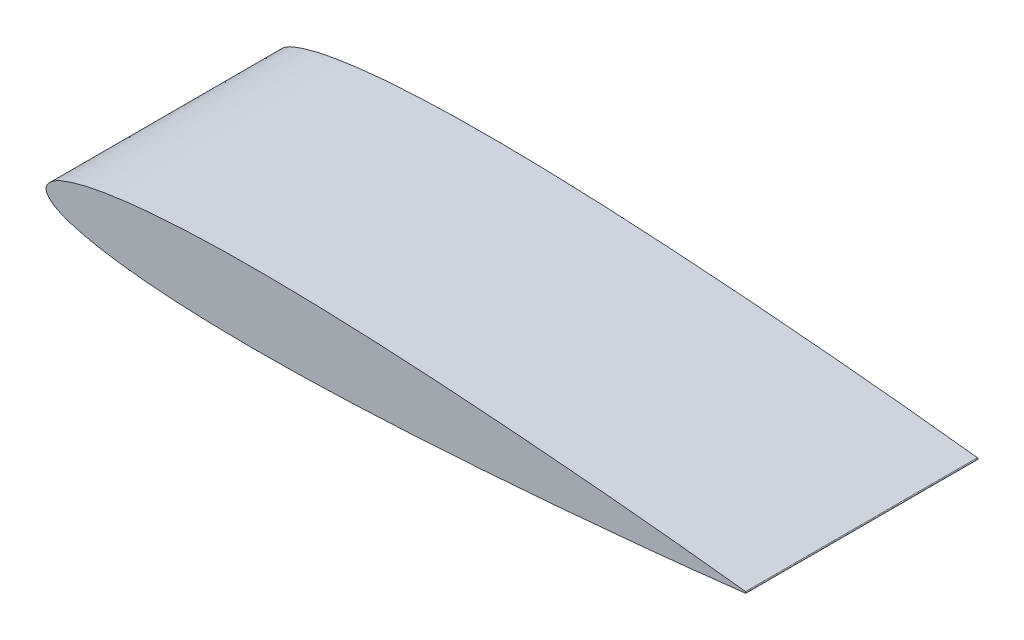
ISO-10303-21;
HEADER;
FILE_DESCRIPTION(('STEP AP214'),'2;1');
FILE_NAME('part.step','',(''),(''),'','','');
FILE_SCHEMA(('AUTOMOTIVE_DESIGN { 1 0 10303 214 1 1 1 1 }'));
ENDSEC;
DATA;
#1=APPLICATION_CONTEXT('core data for automotive mechanical design processes');
#2=APPLICATION_PROTOCOL_DEFINITION('international standard','automotive_design',2000,#1);
#3=PRODUCT_CONTEXT('',#1,'mechanical');
#4=PRODUCT('Part','Part','',(#3));
#5=PRODUCT_RELATED_PRODUCT_CATEGORY('part','',(#4));
#6=PRODUCT_DEFINITION_FORMATION('','',#4);
#7=PRODUCT_DEFINITION_CONTEXT('part definition',#1,'design');
#8=PRODUCT_DEFINITION('design','',#6,#7);
#9=PRODUCT_DEFINITION_SHAPE('','',#8);
#10=(LENGTH_UNIT() NAMED_UNIT(*) SI_UNIT(.MILLI.,.METRE.));
#11=(NAMED_UNIT(*) PLANE_ANGLE_UNIT() SI_UNIT($,.RADIAN.));
#12=(NAMED_UNIT(*) SI_UNIT($,.STERADIAN.) SOLID_ANGLE_UNIT());
#13=UNCERTAINTY_MEASURE_WITH_UNIT(LENGTH_MEASURE(1.E-05),#10,'distance_accuracy_value','');
#14=(GEOMETRIC_REPRESENTATION_CONTEXT(3) GLOBAL_UNCERTAINTY_ASSIGNED_CONTEXT((#13)) GLOBAL_UNIT_ASSIGNED_CONTEXT((#10,
#11,#12)) REPRESENTATION_CONTEXT('',''));
#15=CARTESIAN_POINT('',(0.,0.,0.));
#16=DIRECTION('',(0.,0.,1.));
#17=DIRECTION('',(1.,0.,0.));
#18=AXIS2_PLACEMENT_3D('',#15,#16,#17);
#19=CARTESIAN_POINT('',(72.4,0.07602,24.));
#20=CARTESIAN_POINT('',(71.1935140298983,0.214479461007952,24.));
#21=CARTESIAN_POINT('',(68.7813824894111,0.491301936571411,24.));
#22=CARTESIAN_POINT('',(63.9558290831778,1.00568654797895,24.));
#23=CARTESIAN_POINT('',(57.9237818867626,1.59688809676738,24.));
#24=CARTESIAN_POINT('',(50.6833245520511,2.22342848088294,24.));
#25=CARTESIAN_POINT('',(43.4434701075364,2.7699640233843,24.));
#26=CARTESIAN_POINT('',(36.2034417742481,3.21553314639532,24.));
#27=CARTESIAN_POINT('',(28.9629399608316,3.53256484224223,24.));
#28=CARTESIAN_POINT('',(22.9269802852752,3.64345871484241,24.));
#29=CARTESIAN_POINT('',(18.0990793731902,3.59959310695417,24.));
#30=CARTESIAN_POINT('',(14.4773368415037,3.48046786199714,24.));
#31=CARTESIAN_POINT('',(10.8530154692741,3.25058677560065,24.));
#32=CARTESIAN_POINT('',(7.83506531078091,2.93038711002845,24.));
#33=CARTESIAN_POINT('',(5.41997415859408,2.54651346074703,24.));
#34=CARTESIAN_POINT('',(3.6048012561311,2.17166748868846,24.));
#35=CARTESIAN_POINT('',(2.06147772350359,1.69540955321822,24.));
#36=CARTESIAN_POINT('',(0.781540185820383,1.15661397533353,24.));
#37=CARTESIAN_POINT('',(-0.462789704031004,0.,24.));
#38=CARTESIAN_POINT('',(0.781540185820374,-1.15661397533352,24.));
#39=CARTESIAN_POINT('',(2.0614777235036,-1.69540955321822,24.));
#40=CARTESIAN_POINT('',(3.60480125613111,-2.17166748868846,24.));
#41=CARTESIAN_POINT('',(5.41997415859408,-2.54651346074703,24.));
#42=CARTESIAN_POINT('',(7.8350653107809,-2.93038711002844,24.));
#43=CARTESIAN_POINT('',(10.8530154692742,-3.25058677560066,24.));
#44=CARTESIAN_POINT('',(14.4773368415037,-3.48046786199714,24.));
#45=CARTESIAN_POINT('',(18.0990793731902,-3.59959310695418,24.));
#46=CARTESIAN_POINT('',(22.9269802852752,-3.64345871484241,24.));
#47=CARTESIAN_POINT('',(28.9629399608316,-3.53256484224223,24.));
#48=CARTESIAN_POINT('',(36.2034417742481,-3.21553314639532,24.));
#49=CARTESIAN_POINT('',(43.4434701075364,-2.7699640233843,24.));
#50=CARTESIAN_POINT('',(50.683324552051,-2.22342848088294,24.));
#51=CARTESIAN_POINT('',(57.9237818867626,-1.59688809676738,24.));
#52=CARTESIAN_POINT('',(63.9558290831779,-1.00568654797895,24.));
#53=CARTESIAN_POINT('',(68.7813824894111,-0.491301936571412,24.));
#54=CARTESIAN_POINT('',(71.1935140298983,-0.214479461007952,24.));
#55=CARTESIAN_POINT('',(72.4,-0.07602,24.));
#56=B_SPLINE_CURVE_WITH_KNOTS('',3,(#19,#20,#21,#22,#23,#24,#25,#26,#27,#28,#29,#30,#31,#32,#33,
#34,#35,#36,#37,#38,#39,#40,#41,#42,#43,#44,#45,#46,#47,#48,#49,#50,#51,#52,#53,#54,#55),
.UNSPECIFIED.,.F.,.F.,(4,1,1,1,1,1,1,1,1,1,1,1,1,1,1,1,1,1,1,1,1,1,1,1,1,1,1,1,1,1,1,1,1,1,4),
(0.,0.0248235560251692,0.0496298207515119,0.0991970800533458,0.148712652883516,
0.198182139774084,0.247604472837194,0.296979942928689,0.34631759583347,0.370984298169999,
0.395664019787251,0.420382181676291,0.445198050680487,0.457689209223658,0.470304282792856,
0.483229229601925,0.4900691736526,0.5,0.5099308263474,0.516770770398075,0.529695717207144,
0.542310790776342,0.554801949319513,0.579617818323709,0.604335980212749,0.629015701830001,
0.65368240416653,0.703020057071311,0.752395527162806,0.801817860225916,0.851287347116484,
0.900802919946654,0.950370179248488,0.975176443974831,1.),.UNSPECIFIED.);
#57=DIRECTION('',(0.,0.,-1.));
#58=VECTOR('',#57,1.);
#59=SURFACE_OF_LINEAR_EXTRUSION('',#56,#58);
#60=CARTESIAN_POINT('',(72.4,0.07602,0.));
#61=CARTESIAN_POINT('',(71.1935140298983,0.214479461007952,0.));
#62=CARTESIAN_POINT('',(68.7813824894111,0.491301936571411,0.));
#63=CARTESIAN_POINT('',(63.9558290831778,1.00568654797895,0.));
#64=CARTESIAN_POINT('',(57.9237818867626,1.59688809676738,0.));
#65=CARTESIAN_POINT('',(50.6833245520511,2.22342848088294,0.));
#66=CARTESIAN_POINT('',(43.4434701075364,2.7699640233843,0.));
#67=CARTESIAN_POINT('',(36.2034417742481,3.21553314639532,0.));
#68=CARTESIAN_POINT('',(28.9629399608316,3.53256484224223,0.));
#69=CARTESIAN_POINT('',(22.9269802852752,3.64345871484241,0.));
#70=CARTESIAN_POINT('',(18.0990793731902,3.59959310695417,0.));
#71=CARTESIAN_POINT('',(14.4773368415037,3.48046786199714,0.));
#72=CARTESIAN_POINT('',(10.8530154692741,3.25058677560065,0.));
#73=CARTESIAN_POINT('',(7.83506531078091,2.93038711002845,0.));
#74=CARTESIAN_POINT('',(5.41997415859408,2.54651346074703,0.));
#75=CARTESIAN_POINT('',(3.6048012561311,2.17166748868846,0.));
#76=CARTESIAN_POINT('',(2.06147772350359,1.69540955321822,0.));
#77=CARTESIAN_POINT('',(0.781540185820383,1.15661397533353,0.));
#78=CARTESIAN_POINT('',(-0.462789704031004,0.,0.));
#79=CARTESIAN_POINT('',(0.781540185820374,-1.15661397533352,0.));
#80=CARTESIAN_POINT('',(2.0614777235036,-1.69540955321822,0.));
#81=CARTESIAN_POINT('',(3.60480125613111,-2.17166748868846,0.));
#82=CARTESIAN_POINT('',(5.41997415859408,-2.54651346074703,0.));
#83=CARTESIAN_POINT('',(7.8350653107809,-2.93038711002844,0.));
#84=CARTESIAN_POINT('',(10.8530154692742,-3.25058677560066,0.));
#85=CARTESIAN_POINT('',(14.4773368415037,-3.48046786199714,0.));
#86=CARTESIAN_POINT('',(18.0990793731902,-3.59959310695418,0.));
#87=CARTESIAN_POINT('',(22.9269802852752,-3.64345871484241,0.));
#88=CARTESIAN_POINT('',(28.9629399608316,-3.53256484224223,0.));
#89=CARTESIAN_POINT('',(36.2034417742481,-3.21553314639532,0.));
#90=CARTESIAN_POINT('',(43.4434701075364,-2.7699640233843,0.));
#91=CARTESIAN_POINT('',(50.683324552051,-2.22342848088294,0.));
#92=CARTESIAN_POINT('',(57.9237818867626,-1.59688809676738,0.));
#93=CARTESIAN_POINT('',(63.9558290831779,-1.00568654797895,0.));
#94=CARTESIAN_POINT('',(68.7813824894111,-0.491301936571412,0.));
#95=CARTESIAN_POINT('',(71.1935140298983,-0.214479461007952,0.));
#96=CARTESIAN_POINT('',(72.4,-0.07602,0.));
#97=B_SPLINE_CURVE_WITH_KNOTS('',3,(#60,#61,#62,#63,#64,#65,#66,#67,#68,#69,#70,#71,#72,#73,#74,
#75,#76,#77,#78,#79,#80,#81,#82,#83,#84,#85,#86,#87,#88,#89,#90,#91,#92,#93,#94,#95,#96),
.UNSPECIFIED.,.F.,.F.,(4,1,1,1,1,1,1,1,1,1,1,1,1,1,1,1,1,1,1,1,1,1,1,1,1,1,1,1,1,1,1,1,1,1,4),
(0.,0.0248235560251692,0.0496298207515119,0.0991970800533458,0.148712652883516,
0.198182139774084,0.247604472837194,0.296979942928689,0.34631759583347,0.370984298169999,
0.395664019787251,0.420382181676291,0.445198050680487,0.457689209223658,0.470304282792856,
0.483229229601925,0.4900691736526,0.5,0.5099308263474,0.516770770398075,0.529695717207144,
0.542310790776342,0.554801949319513,0.579617818323709,0.604335980212749,0.629015701830001,
0.65368240416653,0.703020057071311,0.752395527162806,0.801817860225916,0.851287347116484,
0.900802919946654,0.950370179248488,0.975176443974831,1.),.UNSPECIFIED.);
#98=CARTESIAN_POINT('',(72.4,0.07602,0.));
#99=VERTEX_POINT('',#98);
#100=CARTESIAN_POINT('',(72.4,-0.07602,0.));
#101=VERTEX_POINT('',#100);
#102=EDGE_CURVE('E65',#99,#101,#97,.T.);
#103=ORIENTED_EDGE('',*,*,#102,.T.);
#104=DIRECTION('',(0.,0.,-1.));
#105=VECTOR('',#104,1.);
#106=CARTESIAN_POINT('',(72.4,-0.07602,24.));
#107=LINE('',#106,#105);
#108=CARTESIAN_POINT('',(72.4,-0.07602,24.));
#109=VERTEX_POINT('',#108);
#110=EDGE_CURVE('E11',#109,#101,#107,.T.);
#111=ORIENTED_EDGE('',*,*,#110,.F.);
#112=CARTESIAN_POINT('',(72.4,0.07602,24.));
#113=VERTEX_POINT('',#112);
#114=EDGE_CURVE('E64',#113,#109,#56,.T.);
#115=ORIENTED_EDGE('',*,*,#114,.F.);
#116=DIRECTION('',(0.,0.,-1.));
#117=VECTOR('',#116,1.);
#118=CARTESIAN_POINT('',(72.4,0.07602,24.));
#119=LINE('',#118,#117);
#120=EDGE_CURVE('E42',#113,#99,#119,.T.);
#121=ORIENTED_EDGE('',*,*,#120,.T.);
#122=EDGE_LOOP('',(#103,#111,#115,#121));
#123=FACE_BOUND('',#122,.T.);
#124=ADVANCED_FACE('F33',(#123),#59,.F.);
#125=CARTESIAN_POINT('',(72.3912757475125,0.,24.));
#126=DIRECTION('',(0.,0.,-1.));
#127=DIRECTION('',(-1.,0.,0.));
#128=AXIS2_PLACEMENT_3D('',#125,#126,#127);
#129=CYLINDRICAL_SURFACE('',#128,0.076518971382696);
#130=CARTESIAN_POINT('',(72.3912757475125,0.,0.));
#131=DIRECTION('',(0.,0.,1.));
#132=DIRECTION('',(-1.,0.,0.));
#133=AXIS2_PLACEMENT_3D('',#130,#131,#132);
#134=CIRCLE('',#133,0.076518971382696);
#135=EDGE_CURVE('E57',#101,#99,#134,.T.);
#136=ORIENTED_EDGE('',*,*,#135,.T.);
#137=ORIENTED_EDGE('',*,*,#120,.F.);
#138=CARTESIAN_POINT('',(72.3912757475125,0.,24.));
#139=DIRECTION('',(0.,0.,1.));
#140=DIRECTION('',(-1.,0.,0.));
#141=AXIS2_PLACEMENT_3D('',#138,#139,#140);
#142=CIRCLE('',#141,0.076518971382696);
#143=EDGE_CURVE('E49',#109,#113,#142,.T.);
#144=ORIENTED_EDGE('',*,*,#143,.F.);
#145=ORIENTED_EDGE('',*,*,#110,.T.);
#146=EDGE_LOOP('',(#136,#137,#144,#145));
#147=FACE_BOUND('',#146,.T.);
#148=ADVANCED_FACE('F60',(#147),#129,.T.);
#149=CARTESIAN_POINT('',(0.,0.,24.));
#150=DIRECTION('',(0.,0.,-1.));
#151=DIRECTION('',(-1.,0.,0.));
#152=AXIS2_PLACEMENT_3D('',#149,#150,#151);
#153=PLANE('',#152);
#154=ORIENTED_EDGE('',*,*,#114,.T.);
#155=ORIENTED_EDGE('',*,*,#143,.T.);
#156=EDGE_LOOP('',(#154,#155));
#157=FACE_BOUND('',#156,.T.);
#158=ADVANCED_FACE('F82',(#157),#153,.F.);
#159=CARTESIAN_POINT('',(0.,0.,0.));
#160=DIRECTION('',(0.,0.,-1.));
#161=DIRECTION('',(-1.,0.,0.));
#162=AXIS2_PLACEMENT_3D('',#159,#160,#161);
#163=PLANE('',#162);
#164=ORIENTED_EDGE('',*,*,#102,.F.);
#165=ORIENTED_EDGE('',*,*,#135,.F.);
#166=EDGE_LOOP('',(#164,#165));
#167=FACE_BOUND('',#166,.T.);
#168=ADVANCED_FACE('F68',(#167),#163,.T.);
#169=CLOSED_SHELL('',(#124,#148,#158,#168));
#170=MANIFOLD_SOLID_BREP('B2',#169);
#171=ADVANCED_BREP_SHAPE_REPRESENTATION('',(#18,#170),#14);
#172=SHAPE_DEFINITION_REPRESENTATION(#9,#171);
ENDSEC;
END-ISO-10303-21;
